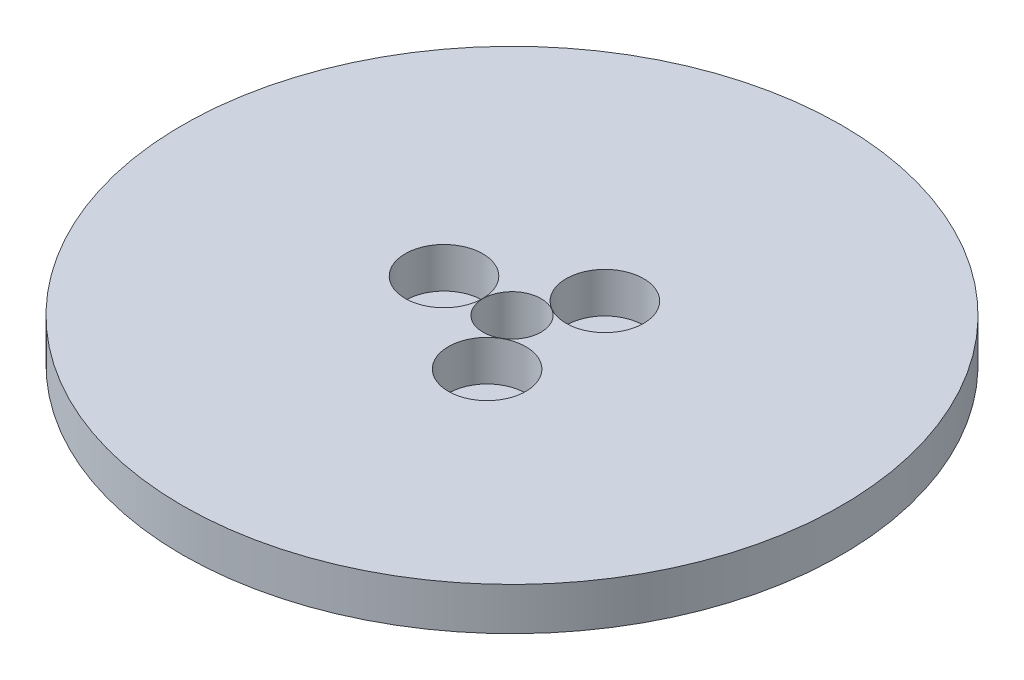
ISO-10303-21;
HEADER;
FILE_DESCRIPTION(('STEP AP214'),'2;1');
FILE_NAME('part.step','',(''),(''),'','','');
FILE_SCHEMA(('AUTOMOTIVE_DESIGN { 1 0 10303 214 1 1 1 1 }'));
ENDSEC;
DATA;
#1=APPLICATION_CONTEXT('core data for automotive mechanical design processes');
#2=APPLICATION_PROTOCOL_DEFINITION('international standard','automotive_design',2000,#1);
#3=PRODUCT_CONTEXT('',#1,'mechanical');
#4=PRODUCT('Part','Part','',(#3));
#5=PRODUCT_RELATED_PRODUCT_CATEGORY('part','',(#4));
#6=PRODUCT_DEFINITION_FORMATION('','',#4);
#7=PRODUCT_DEFINITION_CONTEXT('part definition',#1,'design');
#8=PRODUCT_DEFINITION('design','',#6,#7);
#9=PRODUCT_DEFINITION_SHAPE('','',#8);
#10=(LENGTH_UNIT() NAMED_UNIT(*) SI_UNIT(.MILLI.,.METRE.));
#11=(NAMED_UNIT(*) PLANE_ANGLE_UNIT() SI_UNIT($,.RADIAN.));
#12=(NAMED_UNIT(*) SI_UNIT($,.STERADIAN.) SOLID_ANGLE_UNIT());
#13=UNCERTAINTY_MEASURE_WITH_UNIT(LENGTH_MEASURE(1.E-05),#10,'distance_accuracy_value','');
#14=(GEOMETRIC_REPRESENTATION_CONTEXT(3) GLOBAL_UNCERTAINTY_ASSIGNED_CONTEXT((#13)) GLOBAL_UNIT_ASSIGNED_CONTEXT((#10,
#11,#12)) REPRESENTATION_CONTEXT('',''));
#15=CARTESIAN_POINT('',(0.,0.,0.));
#16=DIRECTION('',(0.,0.,1.));
#17=DIRECTION('',(1.,0.,0.));
#18=AXIS2_PLACEMENT_3D('',#15,#16,#17);
#19=CARTESIAN_POINT('',(0.,11.,0.));
#20=DIRECTION('',(0.,-1.,0.));
#21=DIRECTION('',(0.,0.,-1.));
#22=AXIS2_PLACEMENT_3D('',#19,#20,#21);
#23=CYLINDRICAL_SURFACE('',#22,85.);
#24=CARTESIAN_POINT('',(0.,11.,0.));
#25=DIRECTION('',(0.,1.,0.));
#26=DIRECTION('',(0.,0.,1.));
#27=AXIS2_PLACEMENT_3D('',#24,#25,#26);
#28=CIRCLE('',#27,85.);
#29=CARTESIAN_POINT('',(0.,11.,85.));
#30=VERTEX_POINT('',#29);
#31=EDGE_CURVE('E10',#30,#30,#28,.T.);
#32=ORIENTED_EDGE('',*,*,#31,.F.);
#33=EDGE_LOOP('',(#32));
#34=FACE_BOUND('',#33,.T.);
#35=CARTESIAN_POINT('',(0.,0.,0.));
#36=DIRECTION('',(0.,1.,0.));
#37=DIRECTION('',(0.,0.,1.));
#38=AXIS2_PLACEMENT_3D('',#35,#36,#37);
#39=CIRCLE('',#38,85.);
#40=CARTESIAN_POINT('',(0.,0.,85.));
#41=VERTEX_POINT('',#40);
#42=EDGE_CURVE('E37',#41,#41,#39,.T.);
#43=ORIENTED_EDGE('',*,*,#42,.T.);
#44=EDGE_LOOP('',(#43));
#45=FACE_BOUND('',#44,.T.);
#46=ADVANCED_FACE('F40',(#34,#45),#23,.T.);
#47=CARTESIAN_POINT('',(0.,11.,0.));
#48=DIRECTION('',(0.,1.,0.));
#49=DIRECTION('',(0.,0.,1.));
#50=AXIS2_PLACEMENT_3D('',#47,#48,#49);
#51=PLANE('',#50);
#52=CARTESIAN_POINT('',(8.76998074985437,11.,15.1900522401486));
#53=DIRECTION('',(0.,1.,0.));
#54=DIRECTION('',(0.866025403784436,0.,-0.500000000000004));
#55=AXIS2_PLACEMENT_3D('',#52,#53,#54);
#56=CIRCLE('',#55,10.);
#57=CARTESIAN_POINT('',(17.4302347876987,11.,10.1900522401486));
#58=VERTEX_POINT('',#57);
#59=EDGE_CURVE('E70',#58,#58,#56,.T.);
#60=ORIENTED_EDGE('',*,*,#59,.F.);
#61=EDGE_LOOP('',(#60));
#62=FACE_BOUND('',#61,.T.);
#63=CARTESIAN_POINT('',(8.76998074985416,11.,-15.1900522401487));
#64=DIRECTION('',(0.,1.,0.));
#65=DIRECTION('',(-0.866025403784443,0.,-0.499999999999992));
#66=AXIS2_PLACEMENT_3D('',#63,#64,#65);
#67=CIRCLE('',#66,10.);
#68=CARTESIAN_POINT('',(0.109726712009728,11.,-20.1900522401487));
#69=VERTEX_POINT('',#68);
#70=EDGE_CURVE('E61',#69,#69,#67,.T.);
#71=ORIENTED_EDGE('',*,*,#70,.F.);
#72=EDGE_LOOP('',(#71));
#73=FACE_BOUND('',#72,.T.);
#74=CARTESIAN_POINT('',(-17.5399614997086,11.,0.));
#75=DIRECTION('',(0.,1.,0.));
#76=DIRECTION('',(0.,0.,1.));
#77=AXIS2_PLACEMENT_3D('',#74,#75,#76);
#78=CIRCLE('',#77,10.);
#79=CARTESIAN_POINT('',(-17.5399614997086,11.,10.));
#80=VERTEX_POINT('',#79);
#81=EDGE_CURVE('E54',#80,#80,#78,.T.);
#82=ORIENTED_EDGE('',*,*,#81,.F.);
#83=EDGE_LOOP('',(#82));
#84=FACE_BOUND('',#83,.T.);
#85=CARTESIAN_POINT('',(0.,11.,0.));
#86=DIRECTION('',(0.,1.,0.));
#87=DIRECTION('',(0.,0.,1.));
#88=AXIS2_PLACEMENT_3D('',#85,#86,#87);
#89=CIRCLE('',#88,7.5);
#90=CARTESIAN_POINT('',(0.,11.,7.5));
#91=VERTEX_POINT('',#90);
#92=EDGE_CURVE('E50',#91,#91,#89,.T.);
#93=ORIENTED_EDGE('',*,*,#92,.F.);
#94=EDGE_LOOP('',(#93));
#95=FACE_BOUND('',#94,.T.);
#96=ORIENTED_EDGE('',*,*,#31,.T.);
#97=EDGE_LOOP('',(#96));
#98=FACE_BOUND('',#97,.T.);
#99=ADVANCED_FACE('F85',(#62,#73,#84,#95,#98),#51,.T.);
#100=CARTESIAN_POINT('',(0.,0.,0.));
#101=DIRECTION('',(0.,1.,0.));
#102=DIRECTION('',(0.,0.,1.));
#103=AXIS2_PLACEMENT_3D('',#100,#101,#102);
#104=PLANE('',#103);
#105=CARTESIAN_POINT('',(0.,0.,0.));
#106=DIRECTION('',(0.,1.,0.));
#107=DIRECTION('',(0.,0.,1.));
#108=AXIS2_PLACEMENT_3D('',#105,#106,#107);
#109=CIRCLE('',#108,7.5);
#110=CARTESIAN_POINT('',(0.,0.,7.5));
#111=VERTEX_POINT('',#110);
#112=EDGE_CURVE('E47',#111,#111,#109,.T.);
#113=ORIENTED_EDGE('',*,*,#112,.T.);
#114=EDGE_LOOP('',(#113));
#115=FACE_BOUND('',#114,.T.);
#116=ORIENTED_EDGE('',*,*,#42,.F.);
#117=EDGE_LOOP('',(#116));
#118=FACE_BOUND('',#117,.T.);
#119=ADVANCED_FACE('F84',(#115,#118),#104,.F.);
#120=CARTESIAN_POINT('',(0.,11.,0.));
#121=DIRECTION('',(0.,-1.,0.));
#122=DIRECTION('',(0.,0.,-1.));
#123=AXIS2_PLACEMENT_3D('',#120,#121,#122);
#124=CYLINDRICAL_SURFACE('',#123,7.5);
#125=ORIENTED_EDGE('',*,*,#92,.T.);
#126=EDGE_LOOP('',(#125));
#127=FACE_BOUND('',#126,.T.);
#128=ORIENTED_EDGE('',*,*,#112,.F.);
#129=EDGE_LOOP('',(#128));
#130=FACE_BOUND('',#129,.T.);
#131=ADVANCED_FACE('F91',(#127,#130),#124,.F.);
#132=CARTESIAN_POINT('',(-17.5399614997086,0.587897342650268,0.));
#133=DIRECTION('',(0.,1.,0.));
#134=DIRECTION('',(0.,0.,1.));
#135=AXIS2_PLACEMENT_3D('',#132,#133,#134);
#136=CYLINDRICAL_SURFACE('',#135,10.);
#137=CARTESIAN_POINT('',(-17.5399614997086,0.587897342650268,0.));
#138=DIRECTION('',(0.,1.,0.));
#139=DIRECTION('',(0.,0.,1.));
#140=AXIS2_PLACEMENT_3D('',#137,#138,#139);
#141=CIRCLE('',#140,10.);
#142=CARTESIAN_POINT('',(-17.5399614997086,0.587897342650268,10.));
#143=VERTEX_POINT('',#142);
#144=EDGE_CURVE('E55',#143,#143,#141,.T.);
#145=ORIENTED_EDGE('',*,*,#144,.F.);
#146=EDGE_LOOP('',(#145));
#147=FACE_BOUND('',#146,.T.);
#148=ORIENTED_EDGE('',*,*,#81,.T.);
#149=EDGE_LOOP('',(#148));
#150=FACE_BOUND('',#149,.T.);
#151=ADVANCED_FACE('F96',(#147,#150),#136,.F.);
#152=CARTESIAN_POINT('',(-17.5399614997086,0.587897342650268,0.));
#153=DIRECTION('',(0.,1.,0.));
#154=DIRECTION('',(0.,0.,1.));
#155=AXIS2_PLACEMENT_3D('',#152,#153,#154);
#156=PLANE('',#155);
#157=ORIENTED_EDGE('',*,*,#144,.T.);
#158=EDGE_LOOP('',(#157));
#159=FACE_BOUND('',#158,.T.);
#160=ADVANCED_FACE('F127',(#159),#156,.T.);
#161=CARTESIAN_POINT('',(8.76998074985416,0.587897342650268,-15.1900522401487));
#162=DIRECTION('',(0.,1.,0.));
#163=DIRECTION('',(0.,0.,1.));
#164=AXIS2_PLACEMENT_3D('',#161,#162,#163);
#165=CYLINDRICAL_SURFACE('',#164,10.);
#166=CARTESIAN_POINT('',(8.76998074985416,0.587897342650268,-15.1900522401487));
#167=DIRECTION('',(0.,1.,0.));
#168=DIRECTION('',(-0.866025403784443,0.,-0.499999999999992));
#169=AXIS2_PLACEMENT_3D('',#166,#167,#168);
#170=CIRCLE('',#169,10.);
#171=CARTESIAN_POINT('',(0.109726712009728,0.587897342650268,-20.1900522401487));
#172=VERTEX_POINT('',#171);
#173=EDGE_CURVE('E63',#172,#172,#170,.T.);
#174=ORIENTED_EDGE('',*,*,#173,.F.);
#175=EDGE_LOOP('',(#174));
#176=FACE_BOUND('',#175,.T.);
#177=ORIENTED_EDGE('',*,*,#70,.T.);
#178=EDGE_LOOP('',(#177));
#179=FACE_BOUND('',#178,.T.);
#180=ADVANCED_FACE('F133',(#176,#179),#165,.F.);
#181=CARTESIAN_POINT('',(8.76998074985416,0.587897342650268,-15.1900522401487));
#182=DIRECTION('',(0.,1.,0.));
#183=DIRECTION('',(-0.866025403784443,0.,-0.499999999999992));
#184=AXIS2_PLACEMENT_3D('',#181,#182,#183);
#185=PLANE('',#184);
#186=ORIENTED_EDGE('',*,*,#173,.T.);
#187=EDGE_LOOP('',(#186));
#188=FACE_BOUND('',#187,.T.);
#189=ADVANCED_FACE('F77',(#188),#185,.T.);
#190=CARTESIAN_POINT('',(8.76998074985437,0.587897342650268,15.1900522401486));
#191=DIRECTION('',(0.,1.,0.));
#192=DIRECTION('',(0.,0.,1.));
#193=AXIS2_PLACEMENT_3D('',#190,#191,#192);
#194=CYLINDRICAL_SURFACE('',#193,10.);
#195=CARTESIAN_POINT('',(8.76998074985437,0.587897342650268,15.1900522401486));
#196=DIRECTION('',(0.,1.,0.));
#197=DIRECTION('',(0.866025403784436,0.,-0.500000000000004));
#198=AXIS2_PLACEMENT_3D('',#195,#196,#197);
#199=CIRCLE('',#198,10.);
#200=CARTESIAN_POINT('',(17.4302347876987,0.587897342650268,10.1900522401486));
#201=VERTEX_POINT('',#200);
#202=EDGE_CURVE('E59',#201,#201,#199,.T.);
#203=ORIENTED_EDGE('',*,*,#202,.F.);
#204=EDGE_LOOP('',(#203));
#205=FACE_BOUND('',#204,.T.);
#206=ORIENTED_EDGE('',*,*,#59,.T.);
#207=EDGE_LOOP('',(#206));
#208=FACE_BOUND('',#207,.T.);
#209=ADVANCED_FACE('F73',(#205,#208),#194,.F.);
#210=CARTESIAN_POINT('',(8.76998074985437,0.587897342650268,15.1900522401486));
#211=DIRECTION('',(0.,1.,0.));
#212=DIRECTION('',(0.866025403784436,0.,-0.500000000000004));
#213=AXIS2_PLACEMENT_3D('',#210,#211,#212);
#214=PLANE('',#213);
#215=ORIENTED_EDGE('',*,*,#202,.T.);
#216=EDGE_LOOP('',(#215));
#217=FACE_BOUND('',#216,.T.);
#218=ADVANCED_FACE('F71',(#217),#214,.T.);
#219=CLOSED_SHELL('',(#46,#99,#119,#131,#151,#160,#180,#189,#209,#218));
#220=MANIFOLD_SOLID_BREP('B2',#219);
#221=ADVANCED_BREP_SHAPE_REPRESENTATION('',(#18,#220),#14);
#222=SHAPE_DEFINITION_REPRESENTATION(#9,#221);
ENDSEC;
END-ISO-10303-21;
